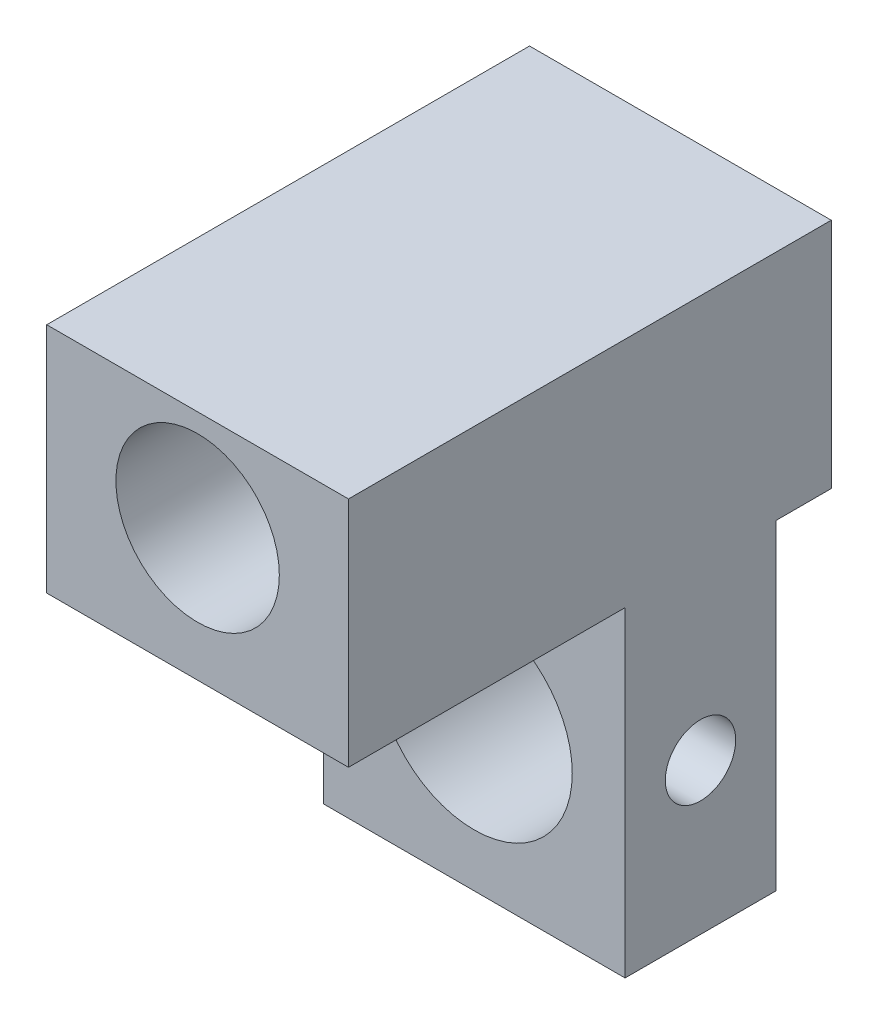
ISO-10303-21;
HEADER;
FILE_DESCRIPTION(('STEP AP214'),'2;1');
FILE_NAME('part.step','',(''),(''),'','','');
FILE_SCHEMA(('AUTOMOTIVE_DESIGN { 1 0 10303 214 1 1 1 1 }'));
ENDSEC;
DATA;
#1=APPLICATION_CONTEXT('core data for automotive mechanical design processes');
#2=APPLICATION_PROTOCOL_DEFINITION('international standard','automotive_design',2000,#1);
#3=PRODUCT_CONTEXT('',#1,'mechanical');
#4=PRODUCT('Part','Part','',(#3));
#5=PRODUCT_RELATED_PRODUCT_CATEGORY('part','',(#4));
#6=PRODUCT_DEFINITION_FORMATION('','',#4);
#7=PRODUCT_DEFINITION_CONTEXT('part definition',#1,'design');
#8=PRODUCT_DEFINITION('design','',#6,#7);
#9=PRODUCT_DEFINITION_SHAPE('','',#8);
#10=(LENGTH_UNIT() NAMED_UNIT(*) SI_UNIT(.MILLI.,.METRE.));
#11=(NAMED_UNIT(*) PLANE_ANGLE_UNIT() SI_UNIT($,.RADIAN.));
#12=(NAMED_UNIT(*) SI_UNIT($,.STERADIAN.) SOLID_ANGLE_UNIT());
#13=UNCERTAINTY_MEASURE_WITH_UNIT(LENGTH_MEASURE(1.E-05),#10,'distance_accuracy_value','');
#14=(GEOMETRIC_REPRESENTATION_CONTEXT(3) GLOBAL_UNCERTAINTY_ASSIGNED_CONTEXT((#13)) GLOBAL_UNIT_ASSIGNED_CONTEXT((#10,
#11,#12)) REPRESENTATION_CONTEXT('',''));
#15=CARTESIAN_POINT('',(0.,0.,0.));
#16=DIRECTION('',(0.,0.,1.));
#17=DIRECTION('',(1.,0.,0.));
#18=AXIS2_PLACEMENT_3D('',#15,#16,#17);
#19=CARTESIAN_POINT('',(0.,0.,6.));
#20=DIRECTION('',(0.,0.,-1.));
#21=DIRECTION('',(-1.,0.,0.));
#22=AXIS2_PLACEMENT_3D('',#19,#20,#21);
#23=PLANE('',#22);
#24=DIRECTION('',(0.,1.,0.));
#25=VECTOR('',#24,1.);
#26=CARTESIAN_POINT('',(6.,-12.,6.));
#27=LINE('',#26,#25);
#28=CARTESIAN_POINT('',(6.,-12.,6.));
#29=VERTEX_POINT('',#28);
#30=CARTESIAN_POINT('',(6.,0.756482094345754,6.));
#31=VERTEX_POINT('',#30);
#32=EDGE_CURVE('E55',#29,#31,#27,.T.);
#33=ORIENTED_EDGE('',*,*,#32,.T.);
#34=DIRECTION('',(-1.,0.,0.));
#35=VECTOR('',#34,1.);
#36=CARTESIAN_POINT('',(0.,0.756482094345756,6.));
#37=LINE('',#36,#35);
#38=CARTESIAN_POINT('',(-6.,0.756482094345756,6.));
#39=VERTEX_POINT('',#38);
#40=EDGE_CURVE('E134',#31,#39,#37,.T.);
#41=ORIENTED_EDGE('',*,*,#40,.T.);
#42=DIRECTION('',(0.,-1.,0.));
#43=VECTOR('',#42,1.);
#44=CARTESIAN_POINT('',(-6.,-12.,6.));
#45=LINE('',#44,#43);
#46=CARTESIAN_POINT('',(-6.,-12.,6.));
#47=VERTEX_POINT('',#46);
#48=EDGE_CURVE('E156',#39,#47,#45,.T.);
#49=ORIENTED_EDGE('',*,*,#48,.T.);
#50=DIRECTION('',(1.,0.,0.));
#51=VECTOR('',#50,1.);
#52=CARTESIAN_POINT('',(-6.,-12.,6.));
#53=LINE('',#52,#51);
#54=EDGE_CURVE('E159',#47,#29,#53,.T.);
#55=ORIENTED_EDGE('',*,*,#54,.T.);
#56=EDGE_LOOP('',(#33,#41,#49,#55));
#57=FACE_BOUND('',#56,.T.);
#58=CARTESIAN_POINT('',(0.,-6.,6.));
#59=DIRECTION('',(0.,0.,1.));
#60=DIRECTION('',(1.,0.,0.));
#61=AXIS2_PLACEMENT_3D('',#58,#59,#60);
#62=CIRCLE('',#61,3.9);
#63=CARTESIAN_POINT('',(3.9,-6.,6.));
#64=VERTEX_POINT('',#63);
#65=EDGE_CURVE('E150',#64,#64,#62,.T.);
#66=ORIENTED_EDGE('',*,*,#65,.F.);
#67=EDGE_LOOP('',(#66));
#68=FACE_BOUND('',#67,.T.);
#69=ADVANCED_FACE('F33',(#57,#68),#23,.F.);
#70=CARTESIAN_POINT('',(0.,0.,0.));
#71=DIRECTION('',(0.,0.,-1.));
#72=DIRECTION('',(-1.,0.,0.));
#73=AXIS2_PLACEMENT_3D('',#70,#71,#72);
#74=PLANE('',#73);
#75=DIRECTION('',(-1.,0.,0.));
#76=VECTOR('',#75,1.);
#77=CARTESIAN_POINT('',(0.,0.756482094345756,0.));
#78=LINE('',#77,#76);
#79=CARTESIAN_POINT('',(6.,0.756482094345755,0.));
#80=VERTEX_POINT('',#79);
#81=CARTESIAN_POINT('',(-6.,0.756482094345756,0.));
#82=VERTEX_POINT('',#81);
#83=EDGE_CURVE('E129',#80,#82,#78,.T.);
#84=ORIENTED_EDGE('',*,*,#83,.F.);
#85=DIRECTION('',(0.,1.,0.));
#86=VECTOR('',#85,1.);
#87=CARTESIAN_POINT('',(6.,-12.,0.));
#88=LINE('',#87,#86);
#89=CARTESIAN_POINT('',(6.,-12.,0.));
#90=VERTEX_POINT('',#89);
#91=EDGE_CURVE('E162',#90,#80,#88,.T.);
#92=ORIENTED_EDGE('',*,*,#91,.F.);
#93=DIRECTION('',(1.,0.,0.));
#94=VECTOR('',#93,1.);
#95=CARTESIAN_POINT('',(-6.,-12.,0.));
#96=LINE('',#95,#94);
#97=CARTESIAN_POINT('',(-6.,-12.,0.));
#98=VERTEX_POINT('',#97);
#99=EDGE_CURVE('E157',#98,#90,#96,.T.);
#100=ORIENTED_EDGE('',*,*,#99,.F.);
#101=DIRECTION('',(0.,-1.,0.));
#102=VECTOR('',#101,1.);
#103=CARTESIAN_POINT('',(-6.,-12.,0.));
#104=LINE('',#103,#102);
#105=EDGE_CURVE('E165',#82,#98,#104,.T.);
#106=ORIENTED_EDGE('',*,*,#105,.F.);
#107=EDGE_LOOP('',(#84,#92,#100,#106));
#108=FACE_BOUND('',#107,.T.);
#109=CARTESIAN_POINT('',(0.,-6.,0.));
#110=DIRECTION('',(0.,0.,-1.));
#111=DIRECTION('',(-1.,0.,0.));
#112=AXIS2_PLACEMENT_3D('',#109,#110,#111);
#113=CIRCLE('',#112,3.9);
#114=CARTESIAN_POINT('',(-3.9,-6.,0.));
#115=VERTEX_POINT('',#114);
#116=EDGE_CURVE('E154',#115,#115,#113,.T.);
#117=ORIENTED_EDGE('',*,*,#116,.F.);
#118=EDGE_LOOP('',(#117));
#119=FACE_BOUND('',#118,.T.);
#120=ADVANCED_FACE('F212',(#108,#119),#74,.T.);
#121=CARTESIAN_POINT('',(6.,-12.,6.));
#122=DIRECTION('',(-1.,0.,0.));
#123=DIRECTION('',(0.,-1.,0.));
#124=AXIS2_PLACEMENT_3D('',#121,#122,#123);
#125=PLANE('',#124);
#126=CARTESIAN_POINT('',(6.,-6.,3.));
#127=DIRECTION('',(1.,0.,0.));
#128=DIRECTION('',(0.,0.,-1.));
#129=AXIS2_PLACEMENT_3D('',#126,#127,#128);
#130=CIRCLE('',#129,1.4);
#131=CARTESIAN_POINT('',(6.,-6.,1.6));
#132=VERTEX_POINT('',#131);
#133=EDGE_CURVE('E143',#132,#132,#130,.T.);
#134=ORIENTED_EDGE('',*,*,#133,.F.);
#135=EDGE_LOOP('',(#134));
#136=FACE_BOUND('',#135,.T.);
#137=DIRECTION('',(0.,-1.,0.));
#138=VECTOR('',#137,1.);
#139=CARTESIAN_POINT('',(6.,12.,-2.2));
#140=LINE('',#139,#138);
#141=CARTESIAN_POINT('',(6.,10.,-2.2));
#142=VERTEX_POINT('',#141);
#143=CARTESIAN_POINT('',(6.,0.756482094345755,-2.2));
#144=VERTEX_POINT('',#143);
#145=EDGE_CURVE('E122',#142,#144,#140,.T.);
#146=ORIENTED_EDGE('',*,*,#145,.F.);
#147=DIRECTION('',(0.,0.,1.));
#148=VECTOR('',#147,1.);
#149=CARTESIAN_POINT('',(6.,10.,6.));
#150=LINE('',#149,#148);
#151=CARTESIAN_POINT('',(6.,10.,17.));
#152=VERTEX_POINT('',#151);
#153=EDGE_CURVE('E48',#142,#152,#150,.T.);
#154=ORIENTED_EDGE('',*,*,#153,.T.);
#155=DIRECTION('',(0.,-1.,0.));
#156=VECTOR('',#155,1.);
#157=CARTESIAN_POINT('',(6.,12.,17.));
#158=LINE('',#157,#156);
#159=CARTESIAN_POINT('',(6.,0.756482094345755,17.));
#160=VERTEX_POINT('',#159);
#161=EDGE_CURVE('E113',#152,#160,#158,.T.);
#162=ORIENTED_EDGE('',*,*,#161,.T.);
#163=DIRECTION('',(0.,0.,-1.));
#164=VECTOR('',#163,1.);
#165=CARTESIAN_POINT('',(6.,0.756482094345755,17.));
#166=LINE('',#165,#164);
#167=EDGE_CURVE('E126',#160,#31,#166,.T.);
#168=ORIENTED_EDGE('',*,*,#167,.T.);
#169=ORIENTED_EDGE('',*,*,#32,.F.);
#170=DIRECTION('',(0.,0.,-1.));
#171=VECTOR('',#170,1.);
#172=CARTESIAN_POINT('',(6.,-12.,6.));
#173=LINE('',#172,#171);
#174=EDGE_CURVE('E161',#29,#90,#173,.T.);
#175=ORIENTED_EDGE('',*,*,#174,.T.);
#176=ORIENTED_EDGE('',*,*,#91,.T.);
#177=EDGE_CURVE('E130',#80,#144,#166,.T.);
#178=ORIENTED_EDGE('',*,*,#177,.T.);
#179=EDGE_LOOP('',(#146,#154,#162,#168,#169,#175,#176,#178));
#180=FACE_BOUND('',#179,.T.);
#181=ADVANCED_FACE('F35',(#136,#180),#125,.F.);
#182=CARTESIAN_POINT('',(-6.,-12.,6.));
#183=DIRECTION('',(1.,0.,0.));
#184=DIRECTION('',(0.,1.,0.));
#185=AXIS2_PLACEMENT_3D('',#182,#183,#184);
#186=PLANE('',#185);
#187=CARTESIAN_POINT('',(-6.,-6.,3.));
#188=DIRECTION('',(1.,0.,0.));
#189=DIRECTION('',(0.,1.,0.));
#190=AXIS2_PLACEMENT_3D('',#187,#188,#189);
#191=CIRCLE('',#190,1.4);
#192=CARTESIAN_POINT('',(-6.,-4.6,3.));
#193=VERTEX_POINT('',#192);
#194=EDGE_CURVE('E147',#193,#193,#191,.T.);
#195=ORIENTED_EDGE('',*,*,#194,.T.);
#196=EDGE_LOOP('',(#195));
#197=FACE_BOUND('',#196,.T.);
#198=DIRECTION('',(0.,1.,0.));
#199=VECTOR('',#198,1.);
#200=CARTESIAN_POINT('',(-6.,12.,17.));
#201=LINE('',#200,#199);
#202=CARTESIAN_POINT('',(-6.,0.756482094345756,17.));
#203=VERTEX_POINT('',#202);
#204=CARTESIAN_POINT('',(-6.,10.,17.));
#205=VERTEX_POINT('',#204);
#206=EDGE_CURVE('E111',#203,#205,#201,.T.);
#207=ORIENTED_EDGE('',*,*,#206,.T.);
#208=DIRECTION('',(0.,0.,1.));
#209=VECTOR('',#208,1.);
#210=CARTESIAN_POINT('',(-6.,10.,-4.1));
#211=LINE('',#210,#209);
#212=CARTESIAN_POINT('',(-6.,10.,-2.2));
#213=VERTEX_POINT('',#212);
#214=EDGE_CURVE('E96',#213,#205,#211,.T.);
#215=ORIENTED_EDGE('',*,*,#214,.F.);
#216=DIRECTION('',(0.,1.,0.));
#217=VECTOR('',#216,1.);
#218=CARTESIAN_POINT('',(-6.,12.,-2.2));
#219=LINE('',#218,#217);
#220=CARTESIAN_POINT('',(-6.,0.756482094345756,-2.2));
#221=VERTEX_POINT('',#220);
#222=EDGE_CURVE('E241',#221,#213,#219,.T.);
#223=ORIENTED_EDGE('',*,*,#222,.F.);
#224=DIRECTION('',(0.,0.,-1.));
#225=VECTOR('',#224,1.);
#226=CARTESIAN_POINT('',(-6.,0.756482094345756,17.));
#227=LINE('',#226,#225);
#228=EDGE_CURVE('E120',#82,#221,#227,.T.);
#229=ORIENTED_EDGE('',*,*,#228,.F.);
#230=ORIENTED_EDGE('',*,*,#105,.T.);
#231=DIRECTION('',(0.,0.,-1.));
#232=VECTOR('',#231,1.);
#233=CARTESIAN_POINT('',(-6.,-12.,6.));
#234=LINE('',#233,#232);
#235=EDGE_CURVE('E41',#47,#98,#234,.T.);
#236=ORIENTED_EDGE('',*,*,#235,.F.);
#237=ORIENTED_EDGE('',*,*,#48,.F.);
#238=EDGE_CURVE('E117',#203,#39,#227,.T.);
#239=ORIENTED_EDGE('',*,*,#238,.F.);
#240=EDGE_LOOP('',(#207,#215,#223,#229,#230,#236,#237,#239));
#241=FACE_BOUND('',#240,.T.);
#242=ADVANCED_FACE('F115',(#197,#241),#186,.F.);
#243=CARTESIAN_POINT('',(-6.,-12.,6.));
#244=DIRECTION('',(0.,1.,0.));
#245=DIRECTION('',(-1.,0.,0.));
#246=AXIS2_PLACEMENT_3D('',#243,#244,#245);
#247=PLANE('',#246);
#248=ORIENTED_EDGE('',*,*,#99,.T.);
#249=ORIENTED_EDGE('',*,*,#174,.F.);
#250=ORIENTED_EDGE('',*,*,#54,.F.);
#251=ORIENTED_EDGE('',*,*,#235,.T.);
#252=EDGE_LOOP('',(#248,#249,#250,#251));
#253=FACE_BOUND('',#252,.T.);
#254=ADVANCED_FACE('F221',(#253),#247,.F.);
#255=CARTESIAN_POINT('',(0.,-6.,-4.));
#256=DIRECTION('',(0.,0.,1.));
#257=DIRECTION('',(1.,0.,0.));
#258=AXIS2_PLACEMENT_3D('',#255,#256,#257);
#259=CYLINDRICAL_SURFACE('',#258,3.9);
#260=CARTESIAN_POINT('',(3.9,-6.,1.6));
#261=CARTESIAN_POINT('',(3.9000012196167,-5.92395499510033,1.59999831169249));
#262=CARTESIAN_POINT('',(3.89775600299561,-5.84792197136607,1.60621561786631));
#263=CARTESIAN_POINT('',(3.88902241186856,-5.69811556525057,1.63082978932277));
#264=CARTESIAN_POINT('',(3.88253424565805,-5.62434207213025,1.64922605671471));
#265=CARTESIAN_POINT('',(3.86601463430233,-5.48123618811741,1.69747227189791));
#266=CARTESIAN_POINT('',(3.85598967075084,-5.41189594552764,1.72730127644546));
#267=CARTESIAN_POINT('',(3.83340464744128,-5.27920565392542,1.79746439551392));
#268=CARTESIAN_POINT('',(3.82084397269692,-5.21585706355282,1.8378010591489));
#269=CARTESIAN_POINT('',(3.79394089698403,-5.09445174420682,1.92949861668378));
#270=CARTESIAN_POINT('',(3.77955104936082,-5.03666298615177,1.98120026545083));
#271=CARTESIAN_POINT('',(3.75085554485017,-4.93036467531654,2.09343652934352));
#272=CARTESIAN_POINT('',(3.73654991170699,-4.88185762846462,2.15397352213025));
#273=CARTESIAN_POINT('',(3.70910267985103,-4.79386608259037,2.28469800703145));
#274=CARTESIAN_POINT('',(3.69601782284826,-4.75474803805803,2.35514525139361));
#275=CARTESIAN_POINT('',(3.67322524251991,-4.68903275280403,2.50216346962077));
#276=CARTESIAN_POINT('',(3.6635162986226,-4.66243098555298,2.57873221789669));
#277=CARTESIAN_POINT('',(3.64907900566845,-4.62354060331773,2.73274804486645));
#278=CARTESIAN_POINT('',(3.64417454885546,-4.61074399586007,2.81004981262929));
#279=CARTESIAN_POINT('',(3.63938380012104,-4.59823866744016,2.96584701946005));
#280=CARTESIAN_POINT('',(3.63949565218307,-4.59852510579798,3.04434200629522));
#281=CARTESIAN_POINT('',(3.64457204354036,-4.61178696504103,3.19578001338667));
#282=CARTESIAN_POINT('',(3.64927369245986,-4.62407498831176,3.26879363539322));
#283=CARTESIAN_POINT('',(3.66256569112226,-4.65986079266218,3.41164384055438));
#284=CARTESIAN_POINT('',(3.67115657742562,-4.68336012048125,3.48147998387951));
#285=CARTESIAN_POINT('',(3.69142862441973,-4.74130703872658,3.61745702321062));
#286=CARTESIAN_POINT('',(3.70316227958009,-4.7759428236225,3.68350955129135));
#287=CARTESIAN_POINT('',(3.72837849997873,-4.85504859900852,3.80907155630992));
#288=CARTESIAN_POINT('',(3.74186163135134,-4.89952177619791,3.86857890364506));
#289=CARTESIAN_POINT('',(3.77006470369777,-5.00024687908289,3.98319014289522));
#290=CARTESIAN_POINT('',(3.78480984766108,-5.05705293152511,4.0378019591422));
#291=CARTESIAN_POINT('',(3.81316156362522,-5.17919242791121,4.13686343304893));
#292=CARTESIAN_POINT('',(3.82676798855853,-5.24452697054366,4.18131177935915));
#293=CARTESIAN_POINT('',(3.85154084435095,-5.38303938127264,4.25926742766457));
#294=CARTESIAN_POINT('',(3.86267294878586,-5.45630884516626,4.29262365514208));
#295=CARTESIAN_POINT('',(3.88099070034096,-5.60791698315356,4.34637742571027));
#296=CARTESIAN_POINT('',(3.88817794751717,-5.68625358755328,4.36678022331105));
#297=CARTESIAN_POINT('',(3.89752131529349,-5.84162115147836,4.39313163867673));
#298=CARTESIAN_POINT('',(3.89990817483392,-5.91852582603575,4.39974375650869));
#299=CARTESIAN_POINT('',(3.90008651585827,-6.07237325330356,4.40024145315384));
#300=CARTESIAN_POINT('',(3.89787891670569,-6.14931599531642,4.39412957807203));
#301=CARTESIAN_POINT('',(3.88926887594737,-6.29827266279151,4.36986593236953));
#302=CARTESIAN_POINT('',(3.8830141557638,-6.37036501824792,4.35213787849975));
#303=CARTESIAN_POINT('',(3.86708638843722,-6.51051043064934,4.30569177069397));
#304=CARTESIAN_POINT('',(3.85741289719998,-6.57856296148403,4.27697228894458));
#305=CARTESIAN_POINT('',(3.83527252644548,-6.71085345210875,4.20846725156225));
#306=CARTESIAN_POINT('',(3.82273425197455,-6.77492865138533,4.16839115108581));
#307=CARTESIAN_POINT('',(3.79626602797771,-6.89565051124812,4.078643620353));
#308=CARTESIAN_POINT('',(3.78233559794809,-6.95229459126753,4.02896887155385));
#309=CARTESIAN_POINT('',(3.753708044979,-7.05968323277399,3.91832692950371));
#310=CARTESIAN_POINT('',(3.73900945109578,-7.10995545022108,3.85690049156232));
#311=CARTESIAN_POINT('',(3.7112353874624,-7.19955788515989,3.72618136154215));
#312=CARTESIAN_POINT('',(3.69816000308124,-7.23888752728668,3.6568882561005));
#313=CARTESIAN_POINT('',(3.67520214931162,-7.30542585581208,3.51207256924058));
#314=CARTESIAN_POINT('',(3.66532401627615,-7.33261809933424,3.43654170040854));
#315=CARTESIAN_POINT('',(3.65011312758804,-7.37374096472348,3.28152558388205));
#316=CARTESIAN_POINT('',(3.64477787499442,-7.3876788721738,3.20204253391873));
#317=CARTESIAN_POINT('',(3.6395700923634,-7.40127705053074,3.04644741176258));
#318=CARTESIAN_POINT('',(3.63939272219386,-7.4017340894273,2.97041451864119));
#319=CARTESIAN_POINT('',(3.64375019229713,-7.39036714212319,2.81941718460211));
#320=CARTESIAN_POINT('',(3.64828465841716,-7.37854413104447,2.74445265932769));
#321=CARTESIAN_POINT('',(3.66131124847128,-7.34355217201768,2.59965464011742));
#322=CARTESIAN_POINT('',(3.66969907690349,-7.3206814505003,2.52973891813816));
#323=CARTESIAN_POINT('',(3.68943491330563,-7.26449686342682,2.39469003039974));
#324=CARTESIAN_POINT('',(3.70078363737501,-7.23118047116736,2.32955802648397));
#325=CARTESIAN_POINT('',(3.7258566332228,-7.15314703640194,2.20245180757275));
#326=CARTESIAN_POINT('',(3.73967020356772,-7.10795042032312,2.14078980329203));
#327=CARTESIAN_POINT('',(3.76778419825237,-7.00820845905142,2.02566946927979));
#328=CARTESIAN_POINT('',(3.7820847695134,-6.95366027223643,1.97221364251063));
#329=CARTESIAN_POINT('',(3.81038389718247,-6.83363577908493,1.87242424589482));
#330=CARTESIAN_POINT('',(3.82433520485861,-6.76776127118753,1.82655426824726));
#331=CARTESIAN_POINT('',(3.84962964042405,-6.62875709761426,1.74656781024201));
#332=CARTESIAN_POINT('',(3.86097292657237,-6.55562787255216,1.71245061664355));
#333=CARTESIAN_POINT('',(3.87983150642292,-6.4035107966054,1.65694994928922));
#334=CARTESIAN_POINT('',(3.8873150046708,-6.32448023704582,1.63567200441325));
#335=CARTESIAN_POINT('',(3.8973976175396,-6.163627742398,1.60720075780537));
#336=CARTESIAN_POINT('',(3.89999868797289,-6.08180693841031,1.60000181623065));
#337=CARTESIAN_POINT('',(3.9,-6.,1.6));
#338=B_SPLINE_CURVE_WITH_KNOTS('',3,(#260,#261,#262,#263,#264,#265,#266,#267,#268,#269,#270,
#271,#272,#273,#274,#275,#276,#277,#278,#279,#280,#281,#282,#283,#284,#285,#286,#287,#288,#289,
#290,#291,#292,#293,#294,#295,#296,#297,#298,#299,#300,#301,#302,#303,#304,#305,#306,#307,#308,
#309,#310,#311,#312,#313,#314,#315,#316,#317,#318,#319,#320,#321,#322,#323,#324,#325,#326,#327,
#328,#329,#330,#331,#332,#333,#334,#335,#336,#337),.UNSPECIFIED.,.T.,.F.,(4,2,2,2,2,2,2,2,2,2,2,
2,2,2,2,2,2,2,2,2,2,2,2,2,2,2,2,2,2,2,2,2,2,2,2,2,2,2,4),(0.,0.227833535463844,
0.455655886932176,0.683062877764925,0.910525088040906,1.14606859009824,1.38167559605455,
1.62536226338224,1.86896073321251,2.10325278104537,2.33745814236469,2.55899142289039,
2.78055527553862,3.00607964075196,3.23167716900896,3.47107553220114,3.71050476654379,
3.95307287851773,4.19554253067482,4.42604872764545,4.65650880414334,4.87899830028609,
5.10151670817442,5.33034125290221,5.559245051197,5.80029144649794,6.04135051371943,
6.28273516658713,6.52398705941029,6.75094959411122,6.97789410777545,7.19902842188308,
7.42021626749336,7.65226773264729,7.88438983568243,8.12762653955332,8.3708484795259,
8.61604321398567,8.86113970688598),.UNSPECIFIED.);
#339=CARTESIAN_POINT('',(3.9,-6.,1.6));
#340=VERTEX_POINT('',#339);
#341=EDGE_CURVE('E151',#340,#340,#338,.T.);
#342=ORIENTED_EDGE('',*,*,#341,.T.);
#343=EDGE_LOOP('',(#342));
#344=FACE_BOUND('',#343,.T.);
#345=CARTESIAN_POINT('',(-3.9,-6.,1.6));
#346=CARTESIAN_POINT('',(-3.9000012196167,-6.07604500489967,1.59999831169249));
#347=CARTESIAN_POINT('',(-3.89775600299561,-6.15207802863393,1.60621561786631));
#348=CARTESIAN_POINT('',(-3.88902241186856,-6.30188443474943,1.63082978932277));
#349=CARTESIAN_POINT('',(-3.88253424565805,-6.37565792786975,1.64922605671471));
#350=CARTESIAN_POINT('',(-3.86601463430233,-6.51876381188259,1.69747227189791));
#351=CARTESIAN_POINT('',(-3.85598967075083,-6.58810405447235,1.72730127644546));
#352=CARTESIAN_POINT('',(-3.83340464744127,-6.72079434607458,1.79746439551392));
#353=CARTESIAN_POINT('',(-3.82084397269692,-6.78414293644718,1.8378010591489));
#354=CARTESIAN_POINT('',(-3.79394089698403,-6.90554825579318,1.92949861668378));
#355=CARTESIAN_POINT('',(-3.77955104936082,-6.96333701384823,1.98120026545082));
#356=CARTESIAN_POINT('',(-3.75085554485017,-7.06963532468346,2.09343652934352));
#357=CARTESIAN_POINT('',(-3.73654991170699,-7.11814237153538,2.15397352213025));
#358=CARTESIAN_POINT('',(-3.70910267985103,-7.20613391740963,2.28469800703144));
#359=CARTESIAN_POINT('',(-3.69601782284826,-7.24525196194196,2.35514525139361));
#360=CARTESIAN_POINT('',(-3.6732252425199,-7.31096724719596,2.50216346962077));
#361=CARTESIAN_POINT('',(-3.6635162986226,-7.33756901444702,2.57873221789669));
#362=CARTESIAN_POINT('',(-3.64907900566845,-7.37645939668227,2.73274804486644));
#363=CARTESIAN_POINT('',(-3.64417454885546,-7.38925600413993,2.81004981262929));
#364=CARTESIAN_POINT('',(-3.63938380012104,-7.40176133255984,2.96584701946005));
#365=CARTESIAN_POINT('',(-3.63949565218307,-7.40147489420202,3.04434200629521));
#366=CARTESIAN_POINT('',(-3.64457204354036,-7.38821303495897,3.19578001338666));
#367=CARTESIAN_POINT('',(-3.64927369245986,-7.37592501168824,3.26879363539322));
#368=CARTESIAN_POINT('',(-3.66256569112225,-7.34013920733782,3.41164384055438));
#369=CARTESIAN_POINT('',(-3.67115657742562,-7.31663987951876,3.48147998387951));
#370=CARTESIAN_POINT('',(-3.69142862441973,-7.25869296127342,3.61745702321061));
#371=CARTESIAN_POINT('',(-3.70316227958008,-7.2240571763775,3.68350955129135));
#372=CARTESIAN_POINT('',(-3.72837849997872,-7.14495140099148,3.80907155630992));
#373=CARTESIAN_POINT('',(-3.74186163135134,-7.1004782238021,3.86857890364505));
#374=CARTESIAN_POINT('',(-3.77006470369777,-6.99975312091712,3.98319014289522));
#375=CARTESIAN_POINT('',(-3.78480984766107,-6.94294706847489,4.0378019591422));
#376=CARTESIAN_POINT('',(-3.81316156362522,-6.82080757208879,4.13686343304893));
#377=CARTESIAN_POINT('',(-3.82676798855853,-6.75547302945635,4.18131177935914));
#378=CARTESIAN_POINT('',(-3.85154084435095,-6.61696061872737,4.25926742766457));
#379=CARTESIAN_POINT('',(-3.86267294878585,-6.54369115483374,4.29262365514208));
#380=CARTESIAN_POINT('',(-3.88099070034095,-6.39208301684645,4.34637742571027));
#381=CARTESIAN_POINT('',(-3.88817794751716,-6.31374641244673,4.36678022331105));
#382=CARTESIAN_POINT('',(-3.89752131529349,-6.15837884852165,4.39313163867672));
#383=CARTESIAN_POINT('',(-3.89990817483392,-6.08147417396426,4.39974375650869));
#384=CARTESIAN_POINT('',(-3.90008651585827,-5.92762674669645,4.40024145315384));
#385=CARTESIAN_POINT('',(-3.89787891670569,-5.85068400468358,4.39412957807203));
#386=CARTESIAN_POINT('',(-3.88926887594736,-5.70172733720849,4.36986593236953));
#387=CARTESIAN_POINT('',(-3.8830141557638,-5.62963498175208,4.35213787849976));
#388=CARTESIAN_POINT('',(-3.86708638843722,-5.48948956935066,4.30569177069398));
#389=CARTESIAN_POINT('',(-3.85741289719997,-5.42143703851597,4.27697228894458));
#390=CARTESIAN_POINT('',(-3.83527252644548,-5.28914654789125,4.20846725156225));
#391=CARTESIAN_POINT('',(-3.82273425197455,-5.22507134861467,4.16839115108581));
#392=CARTESIAN_POINT('',(-3.79626602797771,-5.10434948875188,4.07864362035301));
#393=CARTESIAN_POINT('',(-3.7823355979481,-5.04770540873247,4.02896887155385));
#394=CARTESIAN_POINT('',(-3.753708044979,-4.94031676722601,3.91832692950371));
#395=CARTESIAN_POINT('',(-3.73900945109578,-4.89004454977892,3.85690049156233));
#396=CARTESIAN_POINT('',(-3.7112353874624,-4.80044211484011,3.72618136154215));
#397=CARTESIAN_POINT('',(-3.69816000308124,-4.76111247271333,3.65688825610051));
#398=CARTESIAN_POINT('',(-3.67520214931162,-4.69457414418793,3.51207256924059));
#399=CARTESIAN_POINT('',(-3.66532401627615,-4.66738190066576,3.43654170040854));
#400=CARTESIAN_POINT('',(-3.65011312758804,-4.62625903527652,3.28152558388205));
#401=CARTESIAN_POINT('',(-3.64477787499442,-4.6123211278262,3.20204253391873));
#402=CARTESIAN_POINT('',(-3.6395700923634,-4.59872294946926,3.04644741176259));
#403=CARTESIAN_POINT('',(-3.63939272219386,-4.5982659105727,2.97041451864119));
#404=CARTESIAN_POINT('',(-3.64375019229713,-4.60963285787681,2.81941718460212));
#405=CARTESIAN_POINT('',(-3.64828465841716,-4.62145586895553,2.74445265932769));
#406=CARTESIAN_POINT('',(-3.66131124847128,-4.65644782798232,2.59965464011742));
#407=CARTESIAN_POINT('',(-3.66969907690349,-4.6793185494997,2.52973891813816));
#408=CARTESIAN_POINT('',(-3.68943491330563,-4.73550313657318,2.39469003039975));
#409=CARTESIAN_POINT('',(-3.70078363737501,-4.76881952883264,2.32955802648397));
#410=CARTESIAN_POINT('',(-3.7258566332228,-4.84685296359806,2.20245180757275));
#411=CARTESIAN_POINT('',(-3.73967020356772,-4.89204957967687,2.14078980329203));
#412=CARTESIAN_POINT('',(-3.76778419825236,-4.99179154094858,2.02566946927979));
#413=CARTESIAN_POINT('',(-3.7820847695134,-5.04633972776356,1.97221364251063));
#414=CARTESIAN_POINT('',(-3.81038389718247,-5.16636422091507,1.87242424589482));
#415=CARTESIAN_POINT('',(-3.82433520485861,-5.23223872881247,1.82655426824726));
#416=CARTESIAN_POINT('',(-3.84962964042405,-5.37124290238574,1.74656781024201));
#417=CARTESIAN_POINT('',(-3.86097292657236,-5.44437212744784,1.71245061664355));
#418=CARTESIAN_POINT('',(-3.87983150642292,-5.5964892033946,1.65694994928922));
#419=CARTESIAN_POINT('',(-3.8873150046708,-5.67551976295417,1.63567200441325));
#420=CARTESIAN_POINT('',(-3.89739761753959,-5.836372257602,1.60720075780537));
#421=CARTESIAN_POINT('',(-3.89999868797289,-5.91819306158968,1.60000181623065));
#422=CARTESIAN_POINT('',(-3.9,-6.,1.6));
#423=B_SPLINE_CURVE_WITH_KNOTS('',3,(#345,#346,#347,#348,#349,#350,#351,#352,#353,#354,#355,
#356,#357,#358,#359,#360,#361,#362,#363,#364,#365,#366,#367,#368,#369,#370,#371,#372,#373,#374,
#375,#376,#377,#378,#379,#380,#381,#382,#383,#384,#385,#386,#387,#388,#389,#390,#391,#392,#393,
#394,#395,#396,#397,#398,#399,#400,#401,#402,#403,#404,#405,#406,#407,#408,#409,#410,#411,#412,
#413,#414,#415,#416,#417,#418,#419,#420,#421,#422),.UNSPECIFIED.,.T.,.F.,(4,2,2,2,2,2,2,2,2,2,2,
2,2,2,2,2,2,2,2,2,2,2,2,2,2,2,2,2,2,2,2,2,2,2,2,2,2,2,4),(0.,0.227833535463844,
0.455655886932176,0.683062877764925,0.910525088040906,1.14606859009824,1.38167559605455,
1.62536226338224,1.86896073321251,2.10325278104537,2.33745814236469,2.55899142289039,
2.78055527553862,3.00607964075196,3.23167716900896,3.47107553220114,3.71050476654379,
3.95307287851773,4.19554253067482,4.42604872764545,4.65650880414333,4.87899830028609,
5.10151670817442,5.33034125290221,5.55924505119699,5.80029144649794,6.04135051371942,
6.28273516658712,6.52398705941028,6.75094959411122,6.97789410777544,7.19902842188308,
7.42021626749336,7.65226773264729,7.88438983568242,8.12762653955331,8.3708484795259,
8.61604321398567,8.86113970688598),.UNSPECIFIED.);
#424=CARTESIAN_POINT('',(-3.9,-6.,1.6));
#425=VERTEX_POINT('',#424);
#426=EDGE_CURVE('E146',#425,#425,#423,.T.);
#427=ORIENTED_EDGE('',*,*,#426,.T.);
#428=EDGE_LOOP('',(#427));
#429=FACE_BOUND('',#428,.T.);
#430=ORIENTED_EDGE('',*,*,#116,.T.);
#431=EDGE_LOOP('',(#430));
#432=FACE_BOUND('',#431,.T.);
#433=ORIENTED_EDGE('',*,*,#65,.T.);
#434=EDGE_LOOP('',(#433));
#435=FACE_BOUND('',#434,.T.);
#436=ADVANCED_FACE('F182',(#344,#429,#432,#435),#259,.F.);
#437=CARTESIAN_POINT('',(-16.,-6.,3.));
#438=DIRECTION('',(1.,0.,0.));
#439=DIRECTION('',(0.,0.,-1.));
#440=AXIS2_PLACEMENT_3D('',#437,#438,#439);
#441=CYLINDRICAL_SURFACE('',#440,1.4);
#442=ORIENTED_EDGE('',*,*,#426,.F.);
#443=EDGE_LOOP('',(#442));
#444=FACE_BOUND('',#443,.T.);
#445=ORIENTED_EDGE('',*,*,#194,.F.);
#446=EDGE_LOOP('',(#445));
#447=FACE_BOUND('',#446,.T.);
#448=ADVANCED_FACE('F185',(#444,#447),#441,.F.);
#449=ORIENTED_EDGE('',*,*,#133,.T.);
#450=EDGE_LOOP('',(#449));
#451=FACE_BOUND('',#450,.T.);
#452=ORIENTED_EDGE('',*,*,#341,.F.);
#453=EDGE_LOOP('',(#452));
#454=FACE_BOUND('',#453,.T.);
#455=ADVANCED_FACE('F189',(#451,#454),#441,.F.);
#456=CARTESIAN_POINT('',(-6.,0.756482094345756,17.));
#457=DIRECTION('',(0.,-1.,0.));
#458=DIRECTION('',(1.,0.,0.));
#459=AXIS2_PLACEMENT_3D('',#456,#457,#458);
#460=PLANE('',#459);
#461=ORIENTED_EDGE('',*,*,#40,.F.);
#462=ORIENTED_EDGE('',*,*,#167,.F.);
#463=DIRECTION('',(-1.,0.,0.));
#464=VECTOR('',#463,1.);
#465=CARTESIAN_POINT('',(-6.,0.756482094345756,17.));
#466=LINE('',#465,#464);
#467=EDGE_CURVE('E118',#160,#203,#466,.T.);
#468=ORIENTED_EDGE('',*,*,#467,.T.);
#469=ORIENTED_EDGE('',*,*,#238,.T.);
#470=EDGE_LOOP('',(#461,#462,#468,#469));
#471=FACE_BOUND('',#470,.T.);
#472=ADVANCED_FACE('F206',(#471),#460,.T.);
#473=ORIENTED_EDGE('',*,*,#177,.F.);
#474=ORIENTED_EDGE('',*,*,#83,.T.);
#475=ORIENTED_EDGE('',*,*,#228,.T.);
#476=DIRECTION('',(-1.,0.,0.));
#477=VECTOR('',#476,1.);
#478=CARTESIAN_POINT('',(-6.,0.756482094345756,-2.2));
#479=LINE('',#478,#477);
#480=EDGE_CURVE('E242',#144,#221,#479,.T.);
#481=ORIENTED_EDGE('',*,*,#480,.F.);
#482=EDGE_LOOP('',(#473,#474,#475,#481));
#483=FACE_BOUND('',#482,.T.);
#484=ADVANCED_FACE('F195',(#483),#460,.T.);
#485=CARTESIAN_POINT('',(0.,6.,-0.100000000000001));
#486=DIRECTION('',(0.,0.,1.));
#487=DIRECTION('',(0.,1.,0.));
#488=AXIS2_PLACEMENT_3D('',#485,#486,#487);
#489=SPHERICAL_SURFACE('',#488,3.25);
#490=CARTESIAN_POINT('',(0.,6.,-2.2));
#491=DIRECTION('',(0.,0.,1.));
#492=DIRECTION('',(0.,-1.,0.));
#493=AXIS2_PLACEMENT_3D('',#490,#491,#492);
#494=CIRCLE('',#493,2.48042335096249);
#495=CARTESIAN_POINT('',(0.,3.51957664903751,-2.2));
#496=VERTEX_POINT('',#495);
#497=EDGE_CURVE('E139',#496,#496,#494,.F.);
#498=ORIENTED_EDGE('',*,*,#497,.T.);
#499=EDGE_LOOP('',(#498));
#500=FACE_BOUND('',#499,.T.);
#501=CARTESIAN_POINT('',(0.,6.,-0.1));
#502=DIRECTION('',(0.,0.,1.));
#503=DIRECTION('',(0.,-1.,0.));
#504=AXIS2_PLACEMENT_3D('',#501,#502,#503);
#505=CIRCLE('',#504,3.25);
#506=CARTESIAN_POINT('',(0.,2.75,-0.1));
#507=VERTEX_POINT('',#506);
#508=EDGE_CURVE('E140',#507,#507,#505,.T.);
#509=ORIENTED_EDGE('',*,*,#508,.T.);
#510=EDGE_LOOP('',(#509));
#511=FACE_BOUND('',#510,.T.);
#512=ADVANCED_FACE('F191',(#500,#511),#489,.F.);
#513=CARTESIAN_POINT('',(0.,6.,17.));
#514=DIRECTION('',(0.,0.,1.));
#515=DIRECTION('',(1.,0.,0.));
#516=AXIS2_PLACEMENT_3D('',#513,#514,#515);
#517=PLANE('',#516);
#518=DIRECTION('',(-1.,0.,0.));
#519=VECTOR('',#518,1.);
#520=CARTESIAN_POINT('',(7.1,10.,17.));
#521=LINE('',#520,#519);
#522=EDGE_CURVE('E99',#152,#205,#521,.T.);
#523=ORIENTED_EDGE('',*,*,#522,.T.);
#524=ORIENTED_EDGE('',*,*,#206,.F.);
#525=ORIENTED_EDGE('',*,*,#467,.F.);
#526=ORIENTED_EDGE('',*,*,#161,.F.);
#527=EDGE_LOOP('',(#523,#524,#525,#526));
#528=FACE_BOUND('',#527,.T.);
#529=CARTESIAN_POINT('',(0.,6.,17.));
#530=DIRECTION('',(0.,0.,1.));
#531=DIRECTION('',(1.,0.,0.));
#532=AXIS2_PLACEMENT_3D('',#529,#530,#531);
#533=CIRCLE('',#532,3.25);
#534=CARTESIAN_POINT('',(3.25,6.,17.));
#535=VERTEX_POINT('',#534);
#536=EDGE_CURVE('E136',#535,#535,#533,.T.);
#537=ORIENTED_EDGE('',*,*,#536,.F.);
#538=EDGE_LOOP('',(#537));
#539=FACE_BOUND('',#538,.T.);
#540=ADVANCED_FACE('F108',(#528,#539),#517,.T.);
#541=CARTESIAN_POINT('',(0.,6.,-4.));
#542=DIRECTION('',(0.,0.,1.));
#543=DIRECTION('',(1.,0.,0.));
#544=AXIS2_PLACEMENT_3D('',#541,#542,#543);
#545=CYLINDRICAL_SURFACE('',#544,3.25);
#546=ORIENTED_EDGE('',*,*,#508,.F.);
#547=EDGE_LOOP('',(#546));
#548=FACE_BOUND('',#547,.T.);
#549=ORIENTED_EDGE('',*,*,#536,.T.);
#550=EDGE_LOOP('',(#549));
#551=FACE_BOUND('',#550,.T.);
#552=ADVANCED_FACE('F200',(#548,#551),#545,.F.);
#553=CARTESIAN_POINT('',(-13.,12.2517511887091,-2.2));
#554=DIRECTION('',(0.,0.,1.));
#555=DIRECTION('',(0.,-1.,0.));
#556=AXIS2_PLACEMENT_3D('',#553,#554,#555);
#557=PLANE('',#556);
#558=ORIENTED_EDGE('',*,*,#497,.F.);
#559=EDGE_LOOP('',(#558));
#560=FACE_BOUND('',#559,.T.);
#561=ORIENTED_EDGE('',*,*,#222,.T.);
#562=DIRECTION('',(1.,0.,0.));
#563=VECTOR('',#562,1.);
#564=CARTESIAN_POINT('',(-13.,10.,-2.2));
#565=LINE('',#564,#563);
#566=EDGE_CURVE('E11',#213,#142,#565,.T.);
#567=ORIENTED_EDGE('',*,*,#566,.T.);
#568=ORIENTED_EDGE('',*,*,#145,.T.);
#569=ORIENTED_EDGE('',*,*,#480,.T.);
#570=EDGE_LOOP('',(#561,#567,#568,#569));
#571=FACE_BOUND('',#570,.T.);
#572=ADVANCED_FACE('F197',(#560,#571),#557,.F.);
#573=CARTESIAN_POINT('',(7.1,10.,-4.1));
#574=DIRECTION('',(0.,-1.,0.));
#575=DIRECTION('',(1.,0.,0.));
#576=AXIS2_PLACEMENT_3D('',#573,#574,#575);
#577=PLANE('',#576);
#578=ORIENTED_EDGE('',*,*,#566,.F.);
#579=ORIENTED_EDGE('',*,*,#214,.T.);
#580=ORIENTED_EDGE('',*,*,#522,.F.);
#581=ORIENTED_EDGE('',*,*,#153,.F.);
#582=EDGE_LOOP('',(#578,#579,#580,#581));
#583=FACE_BOUND('',#582,.T.);
#584=ADVANCED_FACE('F98',(#583),#577,.F.);
#585=CLOSED_SHELL('',(#69,#120,#181,#242,#254,#436,#448,#455,#472,#484,#512,#540,#552,#572,#584));
#586=MANIFOLD_SOLID_BREP('B2',#585);
#587=ADVANCED_BREP_SHAPE_REPRESENTATION('',(#18,#586),#14);
#588=SHAPE_DEFINITION_REPRESENTATION(#9,#587);
ENDSEC;
END-ISO-10303-21;
